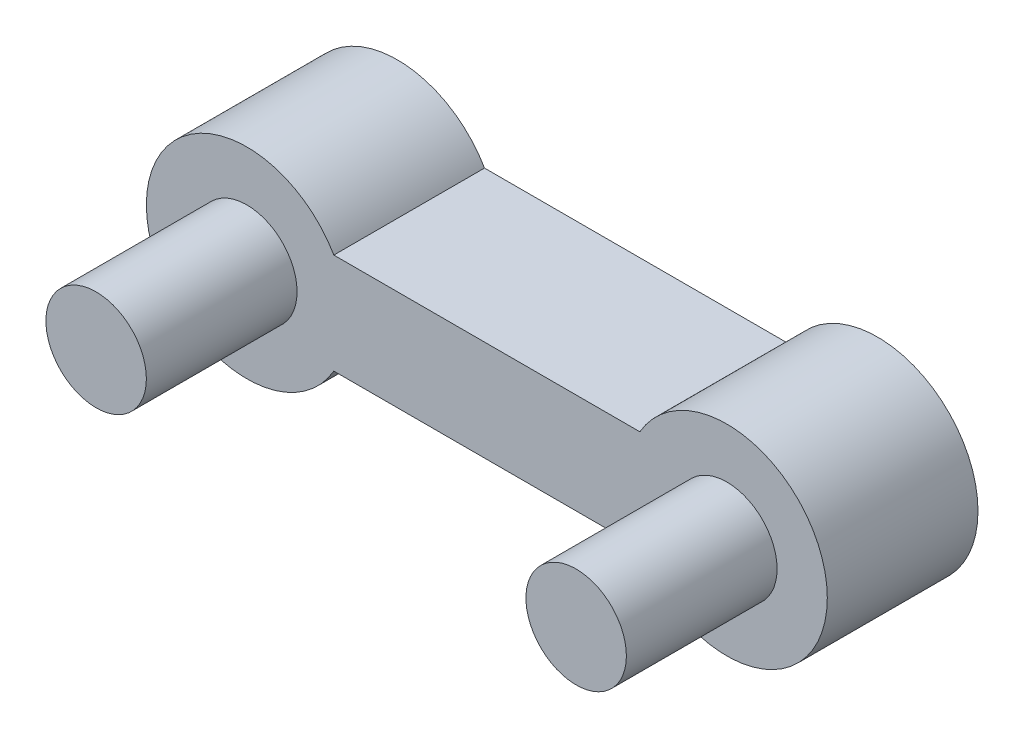
ISO-10303-21;
HEADER;
FILE_DESCRIPTION(('STEP AP214'),'2;1');
FILE_NAME('part.step','',(''),(''),'','','');
FILE_SCHEMA(('AUTOMOTIVE_DESIGN { 1 0 10303 214 1 1 1 1 }'));
ENDSEC;
DATA;
#1=APPLICATION_CONTEXT('core data for automotive mechanical design processes');
#2=APPLICATION_PROTOCOL_DEFINITION('international standard','automotive_design',2000,#1);
#3=PRODUCT_CONTEXT('',#1,'mechanical');
#4=PRODUCT('Part','Part','',(#3));
#5=PRODUCT_RELATED_PRODUCT_CATEGORY('part','',(#4));
#6=PRODUCT_DEFINITION_FORMATION('','',#4);
#7=PRODUCT_DEFINITION_CONTEXT('part definition',#1,'design');
#8=PRODUCT_DEFINITION('design','',#6,#7);
#9=PRODUCT_DEFINITION_SHAPE('','',#8);
#10=(LENGTH_UNIT() NAMED_UNIT(*) SI_UNIT(.MILLI.,.METRE.));
#11=(NAMED_UNIT(*) PLANE_ANGLE_UNIT() SI_UNIT($,.RADIAN.));
#12=(NAMED_UNIT(*) SI_UNIT($,.STERADIAN.) SOLID_ANGLE_UNIT());
#13=UNCERTAINTY_MEASURE_WITH_UNIT(LENGTH_MEASURE(1.E-05),#10,'distance_accuracy_value','');
#14=(GEOMETRIC_REPRESENTATION_CONTEXT(3) GLOBAL_UNCERTAINTY_ASSIGNED_CONTEXT((#13)) GLOBAL_UNIT_ASSIGNED_CONTEXT((#10,
#11,#12)) REPRESENTATION_CONTEXT('',''));
#15=CARTESIAN_POINT('',(0.,0.,0.));
#16=DIRECTION('',(0.,0.,1.));
#17=DIRECTION('',(1.,0.,0.));
#18=AXIS2_PLACEMENT_3D('',#15,#16,#17);
#19=CARTESIAN_POINT('',(-38.2370553074588,12.8003400418104,3.));
#20=DIRECTION('',(0.,0.,-1.));
#21=DIRECTION('',(-1.,0.,0.));
#22=AXIS2_PLACEMENT_3D('',#19,#20,#21);
#23=CYLINDRICAL_SURFACE('',#22,2.);
#24=CARTESIAN_POINT('',(-38.2370553074588,12.8003400418104,0.));
#25=DIRECTION('',(0.,0.,1.));
#26=DIRECTION('',(1.,0.,0.));
#27=AXIS2_PLACEMENT_3D('',#24,#25,#26);
#28=CIRCLE('',#27,2.);
#29=CARTESIAN_POINT('',(-36.50500449989,13.8003400418104,0.));
#30=VERTEX_POINT('',#29);
#31=CARTESIAN_POINT('',(-36.50500449989,11.8003400418104,0.));
#32=VERTEX_POINT('',#31);
#33=EDGE_CURVE('E100',#30,#32,#28,.T.);
#34=ORIENTED_EDGE('',*,*,#33,.T.);
#35=DIRECTION('',(0.,0.,-1.));
#36=VECTOR('',#35,1.);
#37=CARTESIAN_POINT('',(-36.50500449989,11.8003400418104,3.));
#38=LINE('',#37,#36);
#39=CARTESIAN_POINT('',(-36.50500449989,11.8003400418104,3.));
#40=VERTEX_POINT('',#39);
#41=EDGE_CURVE('E11',#40,#32,#38,.T.);
#42=ORIENTED_EDGE('',*,*,#41,.F.);
#43=CARTESIAN_POINT('',(-38.2370553074588,12.8003400418104,3.));
#44=DIRECTION('',(0.,0.,1.));
#45=DIRECTION('',(1.,0.,0.));
#46=AXIS2_PLACEMENT_3D('',#43,#44,#45);
#47=CIRCLE('',#46,2.);
#48=CARTESIAN_POINT('',(-36.50500449989,13.8003400418104,3.));
#49=VERTEX_POINT('',#48);
#50=EDGE_CURVE('E86',#49,#40,#47,.T.);
#51=ORIENTED_EDGE('',*,*,#50,.F.);
#52=DIRECTION('',(0.,0.,-1.));
#53=VECTOR('',#52,1.);
#54=CARTESIAN_POINT('',(-36.50500449989,13.8003400418104,3.));
#55=LINE('',#54,#53);
#56=EDGE_CURVE('E53',#49,#30,#55,.T.);
#57=ORIENTED_EDGE('',*,*,#56,.T.);
#58=EDGE_LOOP('',(#34,#42,#51,#57));
#59=FACE_BOUND('',#58,.T.);
#60=ADVANCED_FACE('F37',(#59),#23,.T.);
#61=CARTESIAN_POINT('',(0.,11.8003400418104,3.));
#62=DIRECTION('',(0.,1.,0.));
#63=DIRECTION('',(-1.,0.,0.));
#64=AXIS2_PLACEMENT_3D('',#61,#62,#63);
#65=PLANE('',#64);
#66=DIRECTION('',(1.,0.,0.));
#67=VECTOR('',#66,1.);
#68=CARTESIAN_POINT('',(0.,11.8003400418104,0.));
#69=LINE('',#68,#67);
#70=CARTESIAN_POINT('',(-30.4126663240277,11.8003400418104,0.));
#71=VERTEX_POINT('',#70);
#72=EDGE_CURVE('E91',#32,#71,#69,.T.);
#73=ORIENTED_EDGE('',*,*,#72,.T.);
#74=DIRECTION('',(0.,0.,-1.));
#75=VECTOR('',#74,1.);
#76=CARTESIAN_POINT('',(-30.4126663240277,11.8003400418104,3.));
#77=LINE('',#76,#75);
#78=CARTESIAN_POINT('',(-30.4126663240277,11.8003400418104,3.));
#79=VERTEX_POINT('',#78);
#80=EDGE_CURVE('E45',#79,#71,#77,.T.);
#81=ORIENTED_EDGE('',*,*,#80,.F.);
#82=DIRECTION('',(1.,0.,0.));
#83=VECTOR('',#82,1.);
#84=CARTESIAN_POINT('',(0.,11.8003400418104,3.));
#85=LINE('',#84,#83);
#86=EDGE_CURVE('E78',#40,#79,#85,.T.);
#87=ORIENTED_EDGE('',*,*,#86,.F.);
#88=ORIENTED_EDGE('',*,*,#41,.T.);
#89=EDGE_LOOP('',(#73,#81,#87,#88));
#90=FACE_BOUND('',#89,.T.);
#91=ADVANCED_FACE('F90',(#90),#65,.F.);
#92=CARTESIAN_POINT('',(-28.6806155164588,12.8003400418104,3.));
#93=DIRECTION('',(0.,0.,-1.));
#94=DIRECTION('',(-1.,0.,0.));
#95=AXIS2_PLACEMENT_3D('',#92,#93,#94);
#96=CYLINDRICAL_SURFACE('',#95,2.);
#97=CARTESIAN_POINT('',(-28.6806155164588,12.8003400418104,0.));
#98=DIRECTION('',(0.,0.,1.));
#99=DIRECTION('',(1.,0.,0.));
#100=AXIS2_PLACEMENT_3D('',#97,#98,#99);
#101=CIRCLE('',#100,2.);
#102=CARTESIAN_POINT('',(-30.4126663240277,13.8003400418104,0.));
#103=VERTEX_POINT('',#102);
#104=EDGE_CURVE('E104',#103,#71,#101,.F.);
#105=ORIENTED_EDGE('',*,*,#104,.F.);
#106=DIRECTION('',(0.,0.,-1.));
#107=VECTOR('',#106,1.);
#108=CARTESIAN_POINT('',(-30.4126663240277,13.8003400418104,3.));
#109=LINE('',#108,#107);
#110=CARTESIAN_POINT('',(-30.4126663240277,13.8003400418104,3.));
#111=VERTEX_POINT('',#110);
#112=EDGE_CURVE('E67',#111,#103,#109,.T.);
#113=ORIENTED_EDGE('',*,*,#112,.F.);
#114=CARTESIAN_POINT('',(-28.6806155164588,12.8003400418104,3.));
#115=DIRECTION('',(0.,0.,1.));
#116=DIRECTION('',(1.,0.,0.));
#117=AXIS2_PLACEMENT_3D('',#114,#115,#116);
#118=CIRCLE('',#117,2.);
#119=EDGE_CURVE('E85',#111,#79,#118,.F.);
#120=ORIENTED_EDGE('',*,*,#119,.T.);
#121=ORIENTED_EDGE('',*,*,#80,.T.);
#122=EDGE_LOOP('',(#105,#113,#120,#121));
#123=FACE_BOUND('',#122,.T.);
#124=ADVANCED_FACE('F94',(#123),#96,.T.);
#125=CARTESIAN_POINT('',(0.,13.8003400418104,3.));
#126=DIRECTION('',(0.,1.,0.));
#127=DIRECTION('',(0.,0.,1.));
#128=AXIS2_PLACEMENT_3D('',#125,#126,#127);
#129=PLANE('',#128);
#130=DIRECTION('',(1.,0.,0.));
#131=VECTOR('',#130,1.);
#132=CARTESIAN_POINT('',(0.,13.8003400418104,0.));
#133=LINE('',#132,#131);
#134=EDGE_CURVE('E106',#30,#103,#133,.T.);
#135=ORIENTED_EDGE('',*,*,#134,.F.);
#136=ORIENTED_EDGE('',*,*,#56,.F.);
#137=DIRECTION('',(1.,0.,0.));
#138=VECTOR('',#137,1.);
#139=CARTESIAN_POINT('',(0.,13.8003400418104,3.));
#140=LINE('',#139,#138);
#141=EDGE_CURVE('E95',#49,#111,#140,.T.);
#142=ORIENTED_EDGE('',*,*,#141,.T.);
#143=ORIENTED_EDGE('',*,*,#112,.T.);
#144=EDGE_LOOP('',(#135,#136,#142,#143));
#145=FACE_BOUND('',#144,.T.);
#146=ADVANCED_FACE('F136',(#145),#129,.T.);
#147=CARTESIAN_POINT('',(0.,0.,3.));
#148=DIRECTION('',(0.,0.,1.));
#149=DIRECTION('',(1.,0.,0.));
#150=AXIS2_PLACEMENT_3D('',#147,#148,#149);
#151=PLANE('',#150);
#152=CARTESIAN_POINT('',(-38.2370553074588,12.8003400418104,3.));
#153=DIRECTION('',(0.,0.,1.));
#154=DIRECTION('',(1.,0.,0.));
#155=AXIS2_PLACEMENT_3D('',#152,#153,#154);
#156=CIRCLE('',#155,0.999999999999998);
#157=CARTESIAN_POINT('',(-37.2370553074588,12.8003400418104,3.));
#158=VERTEX_POINT('',#157);
#159=EDGE_CURVE('E118',#158,#158,#156,.T.);
#160=ORIENTED_EDGE('',*,*,#159,.F.);
#161=EDGE_LOOP('',(#160));
#162=FACE_BOUND('',#161,.T.);
#163=CARTESIAN_POINT('',(-28.6806155164588,12.8003400418104,3.));
#164=DIRECTION('',(0.,0.,1.));
#165=DIRECTION('',(1.,0.,0.));
#166=AXIS2_PLACEMENT_3D('',#163,#164,#165);
#167=CIRCLE('',#166,0.999999999999998);
#168=CARTESIAN_POINT('',(-27.6806155164589,12.8003400418104,3.));
#169=VERTEX_POINT('',#168);
#170=EDGE_CURVE('E112',#169,#169,#167,.T.);
#171=ORIENTED_EDGE('',*,*,#170,.F.);
#172=EDGE_LOOP('',(#171));
#173=FACE_BOUND('',#172,.T.);
#174=ORIENTED_EDGE('',*,*,#50,.T.);
#175=ORIENTED_EDGE('',*,*,#86,.T.);
#176=ORIENTED_EDGE('',*,*,#119,.F.);
#177=ORIENTED_EDGE('',*,*,#141,.F.);
#178=EDGE_LOOP('',(#174,#175,#176,#177));
#179=FACE_BOUND('',#178,.T.);
#180=ADVANCED_FACE('F82',(#162,#173,#179),#151,.T.);
#181=CARTESIAN_POINT('',(0.,0.,0.));
#182=DIRECTION('',(0.,0.,1.));
#183=DIRECTION('',(1.,0.,0.));
#184=AXIS2_PLACEMENT_3D('',#181,#182,#183);
#185=PLANE('',#184);
#186=ORIENTED_EDGE('',*,*,#33,.F.);
#187=ORIENTED_EDGE('',*,*,#134,.T.);
#188=ORIENTED_EDGE('',*,*,#104,.T.);
#189=ORIENTED_EDGE('',*,*,#72,.F.);
#190=EDGE_LOOP('',(#186,#187,#188,#189));
#191=FACE_BOUND('',#190,.T.);
#192=ADVANCED_FACE('F135',(#191),#185,.F.);
#193=CARTESIAN_POINT('',(-28.6806155164588,12.8003400418104,6.));
#194=DIRECTION('',(0.,0.,-1.));
#195=DIRECTION('',(-1.,0.,0.));
#196=AXIS2_PLACEMENT_3D('',#193,#194,#195);
#197=CYLINDRICAL_SURFACE('',#196,0.999999999999998);
#198=CARTESIAN_POINT('',(-28.6806155164588,12.8003400418104,6.));
#199=DIRECTION('',(0.,0.,1.));
#200=DIRECTION('',(1.,0.,0.));
#201=AXIS2_PLACEMENT_3D('',#198,#199,#200);
#202=CIRCLE('',#201,0.999999999999998);
#203=CARTESIAN_POINT('',(-27.6806155164589,12.8003400418104,6.));
#204=VERTEX_POINT('',#203);
#205=EDGE_CURVE('E102',#204,#204,#202,.T.);
#206=ORIENTED_EDGE('',*,*,#205,.F.);
#207=EDGE_LOOP('',(#206));
#208=FACE_BOUND('',#207,.T.);
#209=ORIENTED_EDGE('',*,*,#170,.T.);
#210=EDGE_LOOP('',(#209));
#211=FACE_BOUND('',#210,.T.);
#212=ADVANCED_FACE('F140',(#208,#211),#197,.T.);
#213=CARTESIAN_POINT('',(0.,0.,6.));
#214=DIRECTION('',(0.,0.,1.));
#215=DIRECTION('',(1.,0.,0.));
#216=AXIS2_PLACEMENT_3D('',#213,#214,#215);
#217=PLANE('',#216);
#218=ORIENTED_EDGE('',*,*,#205,.T.);
#219=EDGE_LOOP('',(#218));
#220=FACE_BOUND('',#219,.T.);
#221=ADVANCED_FACE('F129',(#220),#217,.T.);
#222=CARTESIAN_POINT('',(-38.2370553074588,12.8003400418104,6.));
#223=DIRECTION('',(0.,0.,-1.));
#224=DIRECTION('',(-1.,0.,0.));
#225=AXIS2_PLACEMENT_3D('',#222,#223,#224);
#226=CYLINDRICAL_SURFACE('',#225,0.999999999999998);
#227=CARTESIAN_POINT('',(-38.2370553074588,12.8003400418104,6.));
#228=DIRECTION('',(0.,0.,1.));
#229=DIRECTION('',(1.,0.,0.));
#230=AXIS2_PLACEMENT_3D('',#227,#228,#229);
#231=CIRCLE('',#230,0.999999999999998);
#232=CARTESIAN_POINT('',(-37.2370553074588,12.8003400418104,6.));
#233=VERTEX_POINT('',#232);
#234=EDGE_CURVE('E115',#233,#233,#231,.T.);
#235=ORIENTED_EDGE('',*,*,#234,.F.);
#236=EDGE_LOOP('',(#235));
#237=FACE_BOUND('',#236,.T.);
#238=ORIENTED_EDGE('',*,*,#159,.T.);
#239=EDGE_LOOP('',(#238));
#240=FACE_BOUND('',#239,.T.);
#241=ADVANCED_FACE('F126',(#237,#240),#226,.T.);
#242=CARTESIAN_POINT('',(0.,0.,6.));
#243=DIRECTION('',(0.,0.,1.));
#244=DIRECTION('',(1.,0.,0.));
#245=AXIS2_PLACEMENT_3D('',#242,#243,#244);
#246=PLANE('',#245);
#247=ORIENTED_EDGE('',*,*,#234,.T.);
#248=EDGE_LOOP('',(#247));
#249=FACE_BOUND('',#248,.T.);
#250=ADVANCED_FACE('F124',(#249),#246,.T.);
#251=CLOSED_SHELL('',(#60,#91,#124,#146,#180,#192,#212,#221,#241,#250));
#252=MANIFOLD_SOLID_BREP('B2',#251);
#253=ADVANCED_BREP_SHAPE_REPRESENTATION('',(#18,#252),#14);
#254=SHAPE_DEFINITION_REPRESENTATION(#9,#253);
ENDSEC;
END-ISO-10303-21;
